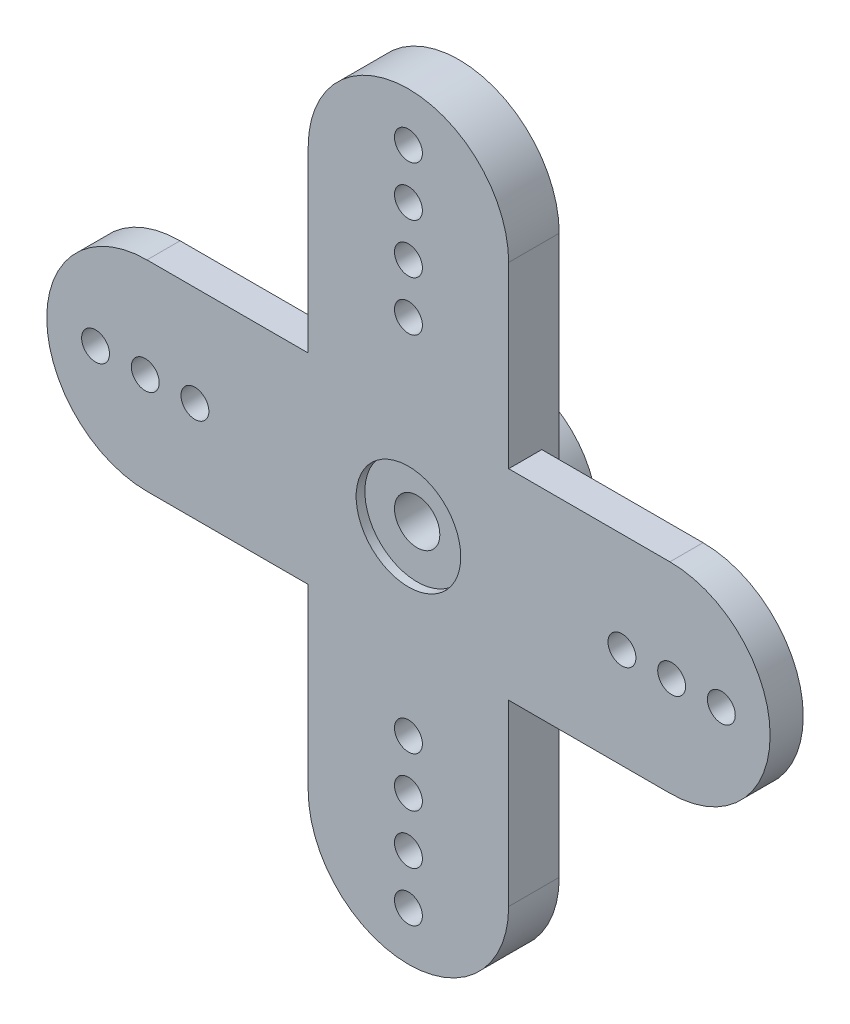
ISO-10303-21;
HEADER;
FILE_DESCRIPTION(('STEP AP214'),'2;1');
FILE_NAME('part.step','',(''),(''),'','','');
FILE_SCHEMA(('AUTOMOTIVE_DESIGN { 1 0 10303 214 1 1 1 1 }'));
ENDSEC;
DATA;
#1=APPLICATION_CONTEXT('core data for automotive mechanical design processes');
#2=APPLICATION_PROTOCOL_DEFINITION('international standard','automotive_design',2000,#1);
#3=PRODUCT_CONTEXT('',#1,'mechanical');
#4=PRODUCT('Part','Part','',(#3));
#5=PRODUCT_RELATED_PRODUCT_CATEGORY('part','',(#4));
#6=PRODUCT_DEFINITION_FORMATION('','',#4);
#7=PRODUCT_DEFINITION_CONTEXT('part definition',#1,'design');
#8=PRODUCT_DEFINITION('design','',#6,#7);
#9=PRODUCT_DEFINITION_SHAPE('','',#8);
#10=(LENGTH_UNIT() NAMED_UNIT(*) SI_UNIT(.MILLI.,.METRE.));
#11=(NAMED_UNIT(*) PLANE_ANGLE_UNIT() SI_UNIT($,.RADIAN.));
#12=(NAMED_UNIT(*) SI_UNIT($,.STERADIAN.) SOLID_ANGLE_UNIT());
#13=UNCERTAINTY_MEASURE_WITH_UNIT(LENGTH_MEASURE(1.E-05),#10,'distance_accuracy_value','');
#14=(GEOMETRIC_REPRESENTATION_CONTEXT(3) GLOBAL_UNCERTAINTY_ASSIGNED_CONTEXT((#13)) GLOBAL_UNIT_ASSIGNED_CONTEXT((#10,
#11,#12)) REPRESENTATION_CONTEXT('',''));
#15=CARTESIAN_POINT('',(0.,0.,0.));
#16=DIRECTION('',(0.,0.,1.));
#17=DIRECTION('',(1.,0.,0.));
#18=AXIS2_PLACEMENT_3D('',#15,#16,#17);
#19=CARTESIAN_POINT('',(0.,16.,-1.));
#20=DIRECTION('',(0.,0.,-1.));
#21=DIRECTION('',(-1.,0.,0.));
#22=AXIS2_PLACEMENT_3D('',#19,#20,#21);
#23=PLANE('',#22);
#24=CARTESIAN_POINT('',(0.,10.4,-1.));
#25=DIRECTION('',(0.,0.,-1.));
#26=DIRECTION('',(-1.,0.,0.));
#27=AXIS2_PLACEMENT_3D('',#24,#25,#26);
#28=CIRCLE('',#27,0.799999999999997);
#29=CARTESIAN_POINT('',(-0.799999999999997,10.4,-1.));
#30=VERTEX_POINT('',#29);
#31=EDGE_CURVE('E458',#30,#30,#28,.T.);
#32=ORIENTED_EDGE('',*,*,#31,.F.);
#33=EDGE_LOOP('',(#32));
#34=FACE_BOUND('',#33,.T.);
#35=CARTESIAN_POINT('',(0.,-18.95,-1.));
#36=DIRECTION('',(0.,0.,-1.));
#37=DIRECTION('',(-1.,0.,0.));
#38=AXIS2_PLACEMENT_3D('',#35,#36,#37);
#39=CIRCLE('',#38,0.799999999999997);
#40=CARTESIAN_POINT('',(-0.799999999999998,-18.95,-1.));
#41=VERTEX_POINT('',#40);
#42=EDGE_CURVE('E454',#41,#41,#39,.T.);
#43=ORIENTED_EDGE('',*,*,#42,.F.);
#44=EDGE_LOOP('',(#43));
#45=FACE_BOUND('',#44,.T.);
#46=CARTESIAN_POINT('',(0.,-16.1,-1.));
#47=DIRECTION('',(0.,0.,-1.));
#48=DIRECTION('',(-1.,0.,0.));
#49=AXIS2_PLACEMENT_3D('',#46,#47,#48);
#50=CIRCLE('',#49,0.799999999999999);
#51=CARTESIAN_POINT('',(-0.8,-16.1,-1.));
#52=VERTEX_POINT('',#51);
#53=EDGE_CURVE('E450',#52,#52,#50,.T.);
#54=ORIENTED_EDGE('',*,*,#53,.F.);
#55=EDGE_LOOP('',(#54));
#56=FACE_BOUND('',#55,.T.);
#57=CARTESIAN_POINT('',(0.,-13.25,-1.));
#58=DIRECTION('',(0.,0.,-1.));
#59=DIRECTION('',(-1.,0.,0.));
#60=AXIS2_PLACEMENT_3D('',#57,#58,#59);
#61=CIRCLE('',#60,0.8);
#62=CARTESIAN_POINT('',(-0.8,-13.25,-1.));
#63=VERTEX_POINT('',#62);
#64=EDGE_CURVE('E446',#63,#63,#61,.T.);
#65=ORIENTED_EDGE('',*,*,#64,.F.);
#66=EDGE_LOOP('',(#65));
#67=FACE_BOUND('',#66,.T.);
#68=CARTESIAN_POINT('',(0.,-10.4,-1.));
#69=DIRECTION('',(0.,0.,-1.));
#70=DIRECTION('',(-1.,0.,0.));
#71=AXIS2_PLACEMENT_3D('',#68,#69,#70);
#72=CIRCLE('',#71,0.799999999999999);
#73=CARTESIAN_POINT('',(-0.8,-10.4,-1.));
#74=VERTEX_POINT('',#73);
#75=EDGE_CURVE('E442',#74,#74,#72,.T.);
#76=ORIENTED_EDGE('',*,*,#75,.F.);
#77=EDGE_LOOP('',(#76));
#78=FACE_BOUND('',#77,.T.);
#79=CARTESIAN_POINT('',(0.,13.25,-1.));
#80=DIRECTION('',(0.,0.,-1.));
#81=DIRECTION('',(-1.,0.,0.));
#82=AXIS2_PLACEMENT_3D('',#79,#80,#81);
#83=CIRCLE('',#82,0.799999999999999);
#84=CARTESIAN_POINT('',(-0.799999999999998,13.25,-1.));
#85=VERTEX_POINT('',#84);
#86=EDGE_CURVE('E427',#85,#85,#83,.T.);
#87=ORIENTED_EDGE('',*,*,#86,.F.);
#88=EDGE_LOOP('',(#87));
#89=FACE_BOUND('',#88,.T.);
#90=CARTESIAN_POINT('',(0.,16.1,-1.));
#91=DIRECTION('',(0.,0.,-1.));
#92=DIRECTION('',(-1.,0.,0.));
#93=AXIS2_PLACEMENT_3D('',#90,#91,#92);
#94=CIRCLE('',#93,0.799999999999997);
#95=CARTESIAN_POINT('',(-0.799999999999997,16.1,-1.));
#96=VERTEX_POINT('',#95);
#97=EDGE_CURVE('E423',#96,#96,#94,.T.);
#98=ORIENTED_EDGE('',*,*,#97,.F.);
#99=EDGE_LOOP('',(#98));
#100=FACE_BOUND('',#99,.T.);
#101=CARTESIAN_POINT('',(0.,18.95,-1.));
#102=DIRECTION('',(0.,0.,-1.));
#103=DIRECTION('',(-1.,0.,0.));
#104=AXIS2_PLACEMENT_3D('',#101,#102,#103);
#105=CIRCLE('',#104,0.799999999999998);
#106=CARTESIAN_POINT('',(-0.799999999999998,18.95,-1.));
#107=VERTEX_POINT('',#106);
#108=EDGE_CURVE('E419',#107,#107,#105,.T.);
#109=ORIENTED_EDGE('',*,*,#108,.F.);
#110=EDGE_LOOP('',(#109));
#111=FACE_BOUND('',#110,.T.);
#112=CARTESIAN_POINT('',(0.,16.,-1.));
#113=DIRECTION('',(0.,0.,-1.));
#114=DIRECTION('',(-1.,0.,0.));
#115=AXIS2_PLACEMENT_3D('',#112,#113,#114);
#116=CIRCLE('',#115,5.75);
#117=CARTESIAN_POINT('',(-5.75,16.,-1.));
#118=VERTEX_POINT('',#117);
#119=CARTESIAN_POINT('',(5.75,16.,-1.));
#120=VERTEX_POINT('',#119);
#121=EDGE_CURVE('E218',#118,#120,#116,.T.);
#122=ORIENTED_EDGE('',*,*,#121,.T.);
#123=DIRECTION('',(0.,-1.,0.));
#124=VECTOR('',#123,1.);
#125=CARTESIAN_POINT('',(5.75,16.,-1.));
#126=LINE('',#125,#124);
#127=CARTESIAN_POINT('',(5.75000000000001,-16.,-1.));
#128=VERTEX_POINT('',#127);
#129=EDGE_CURVE('E220',#120,#128,#126,.T.);
#130=ORIENTED_EDGE('',*,*,#129,.T.);
#131=CARTESIAN_POINT('',(0.,-16.,-1.));
#132=DIRECTION('',(0.,0.,-1.));
#133=DIRECTION('',(-1.,0.,0.));
#134=AXIS2_PLACEMENT_3D('',#131,#132,#133);
#135=CIRCLE('',#134,5.75);
#136=CARTESIAN_POINT('',(-5.74999999999999,-16.,-1.));
#137=VERTEX_POINT('',#136);
#138=EDGE_CURVE('E226',#128,#137,#135,.T.);
#139=ORIENTED_EDGE('',*,*,#138,.T.);
#140=DIRECTION('',(0.,1.,0.));
#141=VECTOR('',#140,1.);
#142=CARTESIAN_POINT('',(-5.75,-5.74999999999999,-1.));
#143=LINE('',#142,#141);
#144=EDGE_CURVE('E187',#137,#118,#143,.T.);
#145=ORIENTED_EDGE('',*,*,#144,.T.);
#146=EDGE_LOOP('',(#122,#130,#139,#145));
#147=FACE_BOUND('',#146,.T.);
#148=CARTESIAN_POINT('',(0.,0.,-1.));
#149=DIRECTION('',(0.,0.,-1.));
#150=DIRECTION('',(-1.,0.,0.));
#151=AXIS2_PLACEMENT_3D('',#148,#149,#150);
#152=CIRCLE('',#151,4.825);
#153=CARTESIAN_POINT('',(-4.825,0.,-1.));
#154=VERTEX_POINT('',#153);
#155=EDGE_CURVE('E318',#154,#154,#152,.T.);
#156=ORIENTED_EDGE('',*,*,#155,.F.);
#157=EDGE_LOOP('',(#156));
#158=FACE_BOUND('',#157,.T.);
#159=ADVANCED_FACE('F33',(#34,#45,#56,#67,#78,#89,#100,#111,#147,#158),#23,.T.);
#160=CARTESIAN_POINT('',(0.,16.,0.));
#161=DIRECTION('',(0.,0.,1.));
#162=DIRECTION('',(1.,0.,0.));
#163=AXIS2_PLACEMENT_3D('',#160,#161,#162);
#164=PLANE('',#163);
#165=CARTESIAN_POINT('',(-12.25,0.,0.));
#166=DIRECTION('',(0.,0.,1.));
#167=DIRECTION('',(1.,0.,0.));
#168=AXIS2_PLACEMENT_3D('',#165,#166,#167);
#169=CIRCLE('',#168,0.800000000000003);
#170=CARTESIAN_POINT('',(-11.45,0.,0.));
#171=VERTEX_POINT('',#170);
#172=EDGE_CURVE('E415',#171,#171,#169,.T.);
#173=ORIENTED_EDGE('',*,*,#172,.T.);
#174=EDGE_LOOP('',(#173));
#175=FACE_BOUND('',#174,.T.);
#176=CARTESIAN_POINT('',(-15.1,0.,0.));
#177=DIRECTION('',(0.,0.,1.));
#178=DIRECTION('',(1.,0.,0.));
#179=AXIS2_PLACEMENT_3D('',#176,#177,#178);
#180=CIRCLE('',#179,0.799999999999999);
#181=CARTESIAN_POINT('',(-14.3,0.,0.));
#182=VERTEX_POINT('',#181);
#183=EDGE_CURVE('E410',#182,#182,#180,.T.);
#184=ORIENTED_EDGE('',*,*,#183,.T.);
#185=EDGE_LOOP('',(#184));
#186=FACE_BOUND('',#185,.T.);
#187=CARTESIAN_POINT('',(-17.95,0.,0.));
#188=DIRECTION('',(0.,0.,1.));
#189=DIRECTION('',(1.,0.,0.));
#190=AXIS2_PLACEMENT_3D('',#187,#188,#189);
#191=CIRCLE('',#190,0.799999999999999);
#192=CARTESIAN_POINT('',(-17.15,0.,0.));
#193=VERTEX_POINT('',#192);
#194=EDGE_CURVE('E306',#193,#193,#191,.T.);
#195=ORIENTED_EDGE('',*,*,#194,.T.);
#196=EDGE_LOOP('',(#195));
#197=FACE_BOUND('',#196,.T.);
#198=DIRECTION('',(0.,1.,0.));
#199=VECTOR('',#198,1.);
#200=CARTESIAN_POINT('',(-5.75,16.,0.));
#201=LINE('',#200,#199);
#202=CARTESIAN_POINT('',(-5.75,-5.74999999999999,0.));
#203=VERTEX_POINT('',#202);
#204=CARTESIAN_POINT('',(-5.75,5.75,0.));
#205=VERTEX_POINT('',#204);
#206=EDGE_CURVE('E42',#203,#205,#201,.T.);
#207=ORIENTED_EDGE('',*,*,#206,.F.);
#208=DIRECTION('',(1.,0.,0.));
#209=VECTOR('',#208,1.);
#210=CARTESIAN_POINT('',(-15.,-5.75,0.));
#211=LINE('',#210,#209);
#212=CARTESIAN_POINT('',(-15.,-5.75,0.));
#213=VERTEX_POINT('',#212);
#214=EDGE_CURVE('E139',#213,#203,#211,.T.);
#215=ORIENTED_EDGE('',*,*,#214,.F.);
#216=CARTESIAN_POINT('',(-15.,0.,0.));
#217=DIRECTION('',(0.,0.,1.));
#218=DIRECTION('',(1.,0.,0.));
#219=AXIS2_PLACEMENT_3D('',#216,#217,#218);
#220=CIRCLE('',#219,5.75);
#221=CARTESIAN_POINT('',(-15.,5.75,0.));
#222=VERTEX_POINT('',#221);
#223=EDGE_CURVE('E137',#222,#213,#220,.T.);
#224=ORIENTED_EDGE('',*,*,#223,.F.);
#225=DIRECTION('',(-1.,0.,0.));
#226=VECTOR('',#225,1.);
#227=CARTESIAN_POINT('',(-15.,5.75,0.));
#228=LINE('',#227,#226);
#229=EDGE_CURVE('E140',#205,#222,#228,.T.);
#230=ORIENTED_EDGE('',*,*,#229,.F.);
#231=EDGE_LOOP('',(#207,#215,#224,#230));
#232=FACE_BOUND('',#231,.T.);
#233=ADVANCED_FACE('F260',(#175,#186,#197,#232),#164,.F.);
#234=CARTESIAN_POINT('',(17.95,0.,0.));
#235=DIRECTION('',(0.,0.,1.));
#236=DIRECTION('',(1.,0.,0.));
#237=AXIS2_PLACEMENT_3D('',#234,#235,#236);
#238=CIRCLE('',#237,0.799999999999999);
#239=CARTESIAN_POINT('',(18.75,0.,0.));
#240=VERTEX_POINT('',#239);
#241=EDGE_CURVE('E439',#240,#240,#238,.T.);
#242=ORIENTED_EDGE('',*,*,#241,.T.);
#243=EDGE_LOOP('',(#242));
#244=FACE_BOUND('',#243,.T.);
#245=CARTESIAN_POINT('',(15.1,0.,0.));
#246=DIRECTION('',(0.,0.,1.));
#247=DIRECTION('',(1.,0.,0.));
#248=AXIS2_PLACEMENT_3D('',#245,#246,#247);
#249=CIRCLE('',#248,0.800000000000001);
#250=CARTESIAN_POINT('',(15.9,0.,0.));
#251=VERTEX_POINT('',#250);
#252=EDGE_CURVE('E435',#251,#251,#249,.T.);
#253=ORIENTED_EDGE('',*,*,#252,.T.);
#254=EDGE_LOOP('',(#253));
#255=FACE_BOUND('',#254,.T.);
#256=CARTESIAN_POINT('',(12.25,0.,0.));
#257=DIRECTION('',(0.,0.,1.));
#258=DIRECTION('',(1.,0.,0.));
#259=AXIS2_PLACEMENT_3D('',#256,#257,#258);
#260=CIRCLE('',#259,0.800000000000003);
#261=CARTESIAN_POINT('',(13.05,0.,0.));
#262=VERTEX_POINT('',#261);
#263=EDGE_CURVE('E431',#262,#262,#260,.T.);
#264=ORIENTED_EDGE('',*,*,#263,.T.);
#265=EDGE_LOOP('',(#264));
#266=FACE_BOUND('',#265,.T.);
#267=DIRECTION('',(0.,-1.,0.));
#268=VECTOR('',#267,1.);
#269=CARTESIAN_POINT('',(5.75,16.,0.));
#270=LINE('',#269,#268);
#271=CARTESIAN_POINT('',(5.75,5.75,0.));
#272=VERTEX_POINT('',#271);
#273=CARTESIAN_POINT('',(5.75,-5.74999999999999,0.));
#274=VERTEX_POINT('',#273);
#275=EDGE_CURVE('E163',#272,#274,#270,.T.);
#276=ORIENTED_EDGE('',*,*,#275,.F.);
#277=DIRECTION('',(-1.,0.,0.));
#278=VECTOR('',#277,1.);
#279=CARTESIAN_POINT('',(5.75,5.74999999999999,0.));
#280=LINE('',#279,#278);
#281=CARTESIAN_POINT('',(15.,5.75,0.));
#282=VERTEX_POINT('',#281);
#283=EDGE_CURVE('E142',#282,#272,#280,.T.);
#284=ORIENTED_EDGE('',*,*,#283,.F.);
#285=CARTESIAN_POINT('',(15.,0.,0.));
#286=DIRECTION('',(0.,0.,1.));
#287=DIRECTION('',(1.,0.,0.));
#288=AXIS2_PLACEMENT_3D('',#285,#286,#287);
#289=CIRCLE('',#288,5.75);
#290=CARTESIAN_POINT('',(15.,-5.75,0.));
#291=VERTEX_POINT('',#290);
#292=EDGE_CURVE('E78',#291,#282,#289,.T.);
#293=ORIENTED_EDGE('',*,*,#292,.F.);
#294=DIRECTION('',(1.,0.,0.));
#295=VECTOR('',#294,1.);
#296=CARTESIAN_POINT('',(5.75,-5.74999999999999,0.));
#297=LINE('',#296,#295);
#298=EDGE_CURVE('E71',#274,#291,#297,.T.);
#299=ORIENTED_EDGE('',*,*,#298,.F.);
#300=EDGE_LOOP('',(#276,#284,#293,#299));
#301=FACE_BOUND('',#300,.T.);
#302=ADVANCED_FACE('F256',(#244,#255,#266,#301),#164,.F.);
#303=CARTESIAN_POINT('',(0.,16.,1.9));
#304=DIRECTION('',(0.,0.,-1.));
#305=DIRECTION('',(-1.,0.,0.));
#306=AXIS2_PLACEMENT_3D('',#303,#304,#305);
#307=CYLINDRICAL_SURFACE('',#306,5.75);
#308=DIRECTION('',(0.,0.,-1.));
#309=VECTOR('',#308,1.);
#310=CARTESIAN_POINT('',(5.75,16.,1.9));
#311=LINE('',#310,#309);
#312=CARTESIAN_POINT('',(5.75,16.,1.9));
#313=VERTEX_POINT('',#312);
#314=EDGE_CURVE('E133',#313,#120,#311,.T.);
#315=ORIENTED_EDGE('',*,*,#314,.T.);
#316=ORIENTED_EDGE('',*,*,#121,.F.);
#317=DIRECTION('',(0.,0.,-1.));
#318=VECTOR('',#317,1.);
#319=CARTESIAN_POINT('',(-5.75,16.,1.9));
#320=LINE('',#319,#318);
#321=CARTESIAN_POINT('',(-5.75,16.,1.9));
#322=VERTEX_POINT('',#321);
#323=EDGE_CURVE('E161',#322,#118,#320,.T.);
#324=ORIENTED_EDGE('',*,*,#323,.F.);
#325=CARTESIAN_POINT('',(0.,16.,1.9));
#326=DIRECTION('',(0.,0.,1.));
#327=DIRECTION('',(1.,0.,0.));
#328=AXIS2_PLACEMENT_3D('',#325,#326,#327);
#329=CIRCLE('',#328,5.75);
#330=EDGE_CURVE('E191',#313,#322,#329,.T.);
#331=ORIENTED_EDGE('',*,*,#330,.F.);
#332=EDGE_LOOP('',(#315,#316,#324,#331));
#333=FACE_BOUND('',#332,.T.);
#334=ADVANCED_FACE('F35',(#333),#307,.T.);
#335=CARTESIAN_POINT('',(-15.,5.75,1.9));
#336=DIRECTION('',(0.,-1.,0.));
#337=DIRECTION('',(1.,0.,0.));
#338=AXIS2_PLACEMENT_3D('',#335,#336,#337);
#339=PLANE('',#338);
#340=ORIENTED_EDGE('',*,*,#229,.T.);
#341=DIRECTION('',(0.,0.,-1.));
#342=VECTOR('',#341,1.);
#343=CARTESIAN_POINT('',(-15.,5.75,1.9));
#344=LINE('',#343,#342);
#345=CARTESIAN_POINT('',(-15.,5.75,1.9));
#346=VERTEX_POINT('',#345);
#347=EDGE_CURVE('E157',#346,#222,#344,.T.);
#348=ORIENTED_EDGE('',*,*,#347,.F.);
#349=DIRECTION('',(-1.,0.,0.));
#350=VECTOR('',#349,1.);
#351=CARTESIAN_POINT('',(-15.,5.75,1.9));
#352=LINE('',#351,#350);
#353=CARTESIAN_POINT('',(-5.75,5.74999999999999,1.9));
#354=VERTEX_POINT('',#353);
#355=EDGE_CURVE('E242',#354,#346,#352,.T.);
#356=ORIENTED_EDGE('',*,*,#355,.F.);
#357=DIRECTION('',(0.,0.,-1.));
#358=VECTOR('',#357,1.);
#359=CARTESIAN_POINT('',(-5.75,5.74999999999999,1.9));
#360=LINE('',#359,#358);
#361=EDGE_CURVE('E160',#354,#205,#360,.T.);
#362=ORIENTED_EDGE('',*,*,#361,.T.);
#363=EDGE_LOOP('',(#340,#348,#356,#362));
#364=FACE_BOUND('',#363,.T.);
#365=ADVANCED_FACE('F268',(#364),#339,.F.);
#366=CARTESIAN_POINT('',(-15.,0.,1.9));
#367=DIRECTION('',(0.,0.,-1.));
#368=DIRECTION('',(-1.,0.,0.));
#369=AXIS2_PLACEMENT_3D('',#366,#367,#368);
#370=CYLINDRICAL_SURFACE('',#369,5.75);
#371=ORIENTED_EDGE('',*,*,#223,.T.);
#372=DIRECTION('',(0.,0.,-1.));
#373=VECTOR('',#372,1.);
#374=CARTESIAN_POINT('',(-15.,-5.75,1.9));
#375=LINE('',#374,#373);
#376=CARTESIAN_POINT('',(-15.,-5.75,1.9));
#377=VERTEX_POINT('',#376);
#378=EDGE_CURVE('E154',#377,#213,#375,.T.);
#379=ORIENTED_EDGE('',*,*,#378,.F.);
#380=CARTESIAN_POINT('',(-15.,0.,1.9));
#381=DIRECTION('',(0.,0.,1.));
#382=DIRECTION('',(1.,0.,0.));
#383=AXIS2_PLACEMENT_3D('',#380,#381,#382);
#384=CIRCLE('',#383,5.75);
#385=EDGE_CURVE('E244',#346,#377,#384,.T.);
#386=ORIENTED_EDGE('',*,*,#385,.F.);
#387=ORIENTED_EDGE('',*,*,#347,.T.);
#388=EDGE_LOOP('',(#371,#379,#386,#387));
#389=FACE_BOUND('',#388,.T.);
#390=ADVANCED_FACE('F538',(#389),#370,.T.);
#391=CARTESIAN_POINT('',(-15.,-5.75,1.9));
#392=DIRECTION('',(0.,1.,0.));
#393=DIRECTION('',(-1.,0.,0.));
#394=AXIS2_PLACEMENT_3D('',#391,#392,#393);
#395=PLANE('',#394);
#396=ORIENTED_EDGE('',*,*,#214,.T.);
#397=DIRECTION('',(0.,0.,-1.));
#398=VECTOR('',#397,1.);
#399=CARTESIAN_POINT('',(-5.75,-5.74999999999999,1.9));
#400=LINE('',#399,#398);
#401=CARTESIAN_POINT('',(-5.75,-5.74999999999999,1.9));
#402=VERTEX_POINT('',#401);
#403=EDGE_CURVE('E153',#402,#203,#400,.T.);
#404=ORIENTED_EDGE('',*,*,#403,.F.);
#405=DIRECTION('',(1.,0.,0.));
#406=VECTOR('',#405,1.);
#407=CARTESIAN_POINT('',(-15.,-5.75,1.9));
#408=LINE('',#407,#406);
#409=EDGE_CURVE('E246',#377,#402,#408,.T.);
#410=ORIENTED_EDGE('',*,*,#409,.F.);
#411=ORIENTED_EDGE('',*,*,#378,.T.);
#412=EDGE_LOOP('',(#396,#404,#410,#411));
#413=FACE_BOUND('',#412,.T.);
#414=ADVANCED_FACE('F528',(#413),#395,.F.);
#415=CARTESIAN_POINT('',(-5.75,-5.74999999999999,1.9));
#416=DIRECTION('',(1.,0.,0.));
#417=DIRECTION('',(0.,1.,0.));
#418=AXIS2_PLACEMENT_3D('',#415,#416,#417);
#419=PLANE('',#418);
#420=ORIENTED_EDGE('',*,*,#403,.T.);
#421=ORIENTED_EDGE('',*,*,#206,.T.);
#422=ORIENTED_EDGE('',*,*,#361,.F.);
#423=DIRECTION('',(0.,-1.,0.));
#424=VECTOR('',#423,1.);
#425=CARTESIAN_POINT('',(-5.75,16.,1.9));
#426=LINE('',#425,#424);
#427=EDGE_CURVE('E87',#322,#354,#426,.T.);
#428=ORIENTED_EDGE('',*,*,#427,.F.);
#429=ORIENTED_EDGE('',*,*,#323,.T.);
#430=ORIENTED_EDGE('',*,*,#144,.F.);
#431=DIRECTION('',(0.,0.,-1.));
#432=VECTOR('',#431,1.);
#433=CARTESIAN_POINT('',(-5.74999999999999,-16.,1.9));
#434=LINE('',#433,#432);
#435=CARTESIAN_POINT('',(-5.74999999999999,-16.,1.9));
#436=VERTEX_POINT('',#435);
#437=EDGE_CURVE('E150',#436,#137,#434,.T.);
#438=ORIENTED_EDGE('',*,*,#437,.F.);
#439=DIRECTION('',(0.,-1.,0.));
#440=VECTOR('',#439,1.);
#441=CARTESIAN_POINT('',(-5.75,-5.74999999999999,1.9));
#442=LINE('',#441,#440);
#443=EDGE_CURVE('E248',#402,#436,#442,.T.);
#444=ORIENTED_EDGE('',*,*,#443,.F.);
#445=EDGE_LOOP('',(#420,#421,#422,#428,#429,#430,#438,#444));
#446=FACE_BOUND('',#445,.T.);
#447=ADVANCED_FACE('F532',(#446),#419,.F.);
#448=CARTESIAN_POINT('',(0.,-16.,1.9));
#449=DIRECTION('',(0.,0.,-1.));
#450=DIRECTION('',(-1.,0.,0.));
#451=AXIS2_PLACEMENT_3D('',#448,#449,#450);
#452=CYLINDRICAL_SURFACE('',#451,5.75);
#453=ORIENTED_EDGE('',*,*,#437,.T.);
#454=ORIENTED_EDGE('',*,*,#138,.F.);
#455=DIRECTION('',(0.,0.,-1.));
#456=VECTOR('',#455,1.);
#457=CARTESIAN_POINT('',(5.75000000000001,-16.,1.9));
#458=LINE('',#457,#456);
#459=CARTESIAN_POINT('',(5.75000000000001,-16.,1.9));
#460=VERTEX_POINT('',#459);
#461=EDGE_CURVE('E147',#460,#128,#458,.T.);
#462=ORIENTED_EDGE('',*,*,#461,.F.);
#463=CARTESIAN_POINT('',(0.,-16.,1.9));
#464=DIRECTION('',(0.,0.,1.));
#465=DIRECTION('',(1.,0.,0.));
#466=AXIS2_PLACEMENT_3D('',#463,#464,#465);
#467=CIRCLE('',#466,5.75);
#468=EDGE_CURVE('E250',#436,#460,#467,.T.);
#469=ORIENTED_EDGE('',*,*,#468,.F.);
#470=EDGE_LOOP('',(#453,#454,#462,#469));
#471=FACE_BOUND('',#470,.T.);
#472=ADVANCED_FACE('F550',(#471),#452,.T.);
#473=CARTESIAN_POINT('',(5.75,-5.74999999999999,1.9));
#474=DIRECTION('',(0.,1.,0.));
#475=DIRECTION('',(-1.,0.,0.));
#476=AXIS2_PLACEMENT_3D('',#473,#474,#475);
#477=PLANE('',#476);
#478=ORIENTED_EDGE('',*,*,#298,.T.);
#479=DIRECTION('',(0.,0.,-1.));
#480=VECTOR('',#479,1.);
#481=CARTESIAN_POINT('',(15.,-5.75,1.9));
#482=LINE('',#481,#480);
#483=CARTESIAN_POINT('',(15.,-5.75,1.9));
#484=VERTEX_POINT('',#483);
#485=EDGE_CURVE('E127',#484,#291,#482,.T.);
#486=ORIENTED_EDGE('',*,*,#485,.F.);
#487=DIRECTION('',(1.,0.,0.));
#488=VECTOR('',#487,1.);
#489=CARTESIAN_POINT('',(5.75,-5.74999999999999,1.9));
#490=LINE('',#489,#488);
#491=CARTESIAN_POINT('',(5.75,-5.74999999999999,1.9));
#492=VERTEX_POINT('',#491);
#493=EDGE_CURVE('E120',#492,#484,#490,.T.);
#494=ORIENTED_EDGE('',*,*,#493,.F.);
#495=DIRECTION('',(0.,0.,-1.));
#496=VECTOR('',#495,1.);
#497=CARTESIAN_POINT('',(5.75,-5.74999999999999,1.9));
#498=LINE('',#497,#496);
#499=EDGE_CURVE('E146',#492,#274,#498,.T.);
#500=ORIENTED_EDGE('',*,*,#499,.T.);
#501=EDGE_LOOP('',(#478,#486,#494,#500));
#502=FACE_BOUND('',#501,.T.);
#503=ADVANCED_FACE('F255',(#502),#477,.F.);
#504=CARTESIAN_POINT('',(15.,0.,1.9));
#505=DIRECTION('',(0.,0.,-1.));
#506=DIRECTION('',(-1.,0.,0.));
#507=AXIS2_PLACEMENT_3D('',#504,#505,#506);
#508=CYLINDRICAL_SURFACE('',#507,5.75);
#509=ORIENTED_EDGE('',*,*,#292,.T.);
#510=DIRECTION('',(0.,0.,-1.));
#511=VECTOR('',#510,1.);
#512=CARTESIAN_POINT('',(15.,5.75,1.9));
#513=LINE('',#512,#511);
#514=CARTESIAN_POINT('',(15.,5.75,1.9));
#515=VERTEX_POINT('',#514);
#516=EDGE_CURVE('E122',#515,#282,#513,.T.);
#517=ORIENTED_EDGE('',*,*,#516,.F.);
#518=CARTESIAN_POINT('',(15.,0.,1.9));
#519=DIRECTION('',(0.,0.,1.));
#520=DIRECTION('',(1.,0.,0.));
#521=AXIS2_PLACEMENT_3D('',#518,#519,#520);
#522=CIRCLE('',#521,5.75);
#523=EDGE_CURVE('E114',#484,#515,#522,.T.);
#524=ORIENTED_EDGE('',*,*,#523,.F.);
#525=ORIENTED_EDGE('',*,*,#485,.T.);
#526=EDGE_LOOP('',(#509,#517,#524,#525));
#527=FACE_BOUND('',#526,.T.);
#528=ADVANCED_FACE('F123',(#527),#508,.T.);
#529=CARTESIAN_POINT('',(5.75,5.74999999999999,1.9));
#530=DIRECTION('',(0.,-1.,0.));
#531=DIRECTION('',(1.,0.,0.));
#532=AXIS2_PLACEMENT_3D('',#529,#530,#531);
#533=PLANE('',#532);
#534=ORIENTED_EDGE('',*,*,#283,.T.);
#535=DIRECTION('',(0.,0.,-1.));
#536=VECTOR('',#535,1.);
#537=CARTESIAN_POINT('',(5.75,5.74999999999999,1.9));
#538=LINE('',#537,#536);
#539=CARTESIAN_POINT('',(5.75,5.74999999999999,1.9));
#540=VERTEX_POINT('',#539);
#541=EDGE_CURVE('E128',#540,#272,#538,.T.);
#542=ORIENTED_EDGE('',*,*,#541,.F.);
#543=DIRECTION('',(-1.,0.,0.));
#544=VECTOR('',#543,1.);
#545=CARTESIAN_POINT('',(5.75,5.74999999999999,1.9));
#546=LINE('',#545,#544);
#547=EDGE_CURVE('E117',#515,#540,#546,.T.);
#548=ORIENTED_EDGE('',*,*,#547,.F.);
#549=ORIENTED_EDGE('',*,*,#516,.T.);
#550=EDGE_LOOP('',(#534,#542,#548,#549));
#551=FACE_BOUND('',#550,.T.);
#552=ADVANCED_FACE('F130',(#551),#533,.F.);
#553=CARTESIAN_POINT('',(5.75,5.74999999999999,1.9));
#554=DIRECTION('',(-1.,0.,0.));
#555=DIRECTION('',(0.,-1.,0.));
#556=AXIS2_PLACEMENT_3D('',#553,#554,#555);
#557=PLANE('',#556);
#558=ORIENTED_EDGE('',*,*,#541,.T.);
#559=ORIENTED_EDGE('',*,*,#275,.T.);
#560=ORIENTED_EDGE('',*,*,#499,.F.);
#561=DIRECTION('',(0.,1.,0.));
#562=VECTOR('',#561,1.);
#563=CARTESIAN_POINT('',(5.75000000000001,-16.,1.9));
#564=LINE('',#563,#562);
#565=EDGE_CURVE('E252',#460,#492,#564,.T.);
#566=ORIENTED_EDGE('',*,*,#565,.F.);
#567=ORIENTED_EDGE('',*,*,#461,.T.);
#568=ORIENTED_EDGE('',*,*,#129,.F.);
#569=ORIENTED_EDGE('',*,*,#314,.F.);
#570=DIRECTION('',(0.,1.,0.));
#571=VECTOR('',#570,1.);
#572=CARTESIAN_POINT('',(5.75,5.74999999999999,1.9));
#573=LINE('',#572,#571);
#574=EDGE_CURVE('E50',#540,#313,#573,.T.);
#575=ORIENTED_EDGE('',*,*,#574,.F.);
#576=EDGE_LOOP('',(#558,#559,#560,#566,#567,#568,#569,#575));
#577=FACE_BOUND('',#576,.T.);
#578=ADVANCED_FACE('F196',(#577),#557,.F.);
#579=CARTESIAN_POINT('',(0.,16.,1.9));
#580=DIRECTION('',(0.,0.,1.));
#581=DIRECTION('',(1.,0.,0.));
#582=AXIS2_PLACEMENT_3D('',#579,#580,#581);
#583=PLANE('',#582);
#584=CARTESIAN_POINT('',(0.,10.4,1.9));
#585=DIRECTION('',(0.,0.,1.));
#586=DIRECTION('',(1.,0.,0.));
#587=AXIS2_PLACEMENT_3D('',#584,#585,#586);
#588=CIRCLE('',#587,0.799999999999997);
#589=CARTESIAN_POINT('',(0.799999999999998,10.4,1.9));
#590=VERTEX_POINT('',#589);
#591=EDGE_CURVE('E358',#590,#590,#588,.T.);
#592=ORIENTED_EDGE('',*,*,#591,.F.);
#593=EDGE_LOOP('',(#592));
#594=FACE_BOUND('',#593,.T.);
#595=CARTESIAN_POINT('',(0.,-18.95,1.9));
#596=DIRECTION('',(0.,0.,1.));
#597=DIRECTION('',(1.,0.,0.));
#598=AXIS2_PLACEMENT_3D('',#595,#596,#597);
#599=CIRCLE('',#598,0.799999999999997);
#600=CARTESIAN_POINT('',(0.799999999999997,-18.95,1.9));
#601=VERTEX_POINT('',#600);
#602=EDGE_CURVE('E362',#601,#601,#599,.T.);
#603=ORIENTED_EDGE('',*,*,#602,.F.);
#604=EDGE_LOOP('',(#603));
#605=FACE_BOUND('',#604,.T.);
#606=CARTESIAN_POINT('',(0.,-16.1,1.9));
#607=DIRECTION('',(0.,0.,1.));
#608=DIRECTION('',(1.,0.,0.));
#609=AXIS2_PLACEMENT_3D('',#606,#607,#608);
#610=CIRCLE('',#609,0.799999999999999);
#611=CARTESIAN_POINT('',(0.799999999999998,-16.1,1.9));
#612=VERTEX_POINT('',#611);
#613=EDGE_CURVE('E366',#612,#612,#610,.T.);
#614=ORIENTED_EDGE('',*,*,#613,.F.);
#615=EDGE_LOOP('',(#614));
#616=FACE_BOUND('',#615,.T.);
#617=CARTESIAN_POINT('',(0.,-13.25,1.9));
#618=DIRECTION('',(0.,0.,1.));
#619=DIRECTION('',(1.,0.,0.));
#620=AXIS2_PLACEMENT_3D('',#617,#618,#619);
#621=CIRCLE('',#620,0.8);
#622=CARTESIAN_POINT('',(0.799999999999999,-13.25,1.9));
#623=VERTEX_POINT('',#622);
#624=EDGE_CURVE('E370',#623,#623,#621,.T.);
#625=ORIENTED_EDGE('',*,*,#624,.F.);
#626=EDGE_LOOP('',(#625));
#627=FACE_BOUND('',#626,.T.);
#628=CARTESIAN_POINT('',(0.,-10.4,1.9));
#629=DIRECTION('',(0.,0.,1.));
#630=DIRECTION('',(1.,0.,0.));
#631=AXIS2_PLACEMENT_3D('',#628,#629,#630);
#632=CIRCLE('',#631,0.799999999999999);
#633=CARTESIAN_POINT('',(0.799999999999999,-10.4,1.9));
#634=VERTEX_POINT('',#633);
#635=EDGE_CURVE('E374',#634,#634,#632,.T.);
#636=ORIENTED_EDGE('',*,*,#635,.F.);
#637=EDGE_LOOP('',(#636));
#638=FACE_BOUND('',#637,.T.);
#639=CARTESIAN_POINT('',(17.95,0.,1.9));
#640=DIRECTION('',(0.,0.,1.));
#641=DIRECTION('',(1.,0.,0.));
#642=AXIS2_PLACEMENT_3D('',#639,#640,#641);
#643=CIRCLE('',#642,0.799999999999999);
#644=CARTESIAN_POINT('',(18.75,0.,1.9));
#645=VERTEX_POINT('',#644);
#646=EDGE_CURVE('E378',#645,#645,#643,.T.);
#647=ORIENTED_EDGE('',*,*,#646,.F.);
#648=EDGE_LOOP('',(#647));
#649=FACE_BOUND('',#648,.T.);
#650=CARTESIAN_POINT('',(15.1,0.,1.9));
#651=DIRECTION('',(0.,0.,1.));
#652=DIRECTION('',(1.,0.,0.));
#653=AXIS2_PLACEMENT_3D('',#650,#651,#652);
#654=CIRCLE('',#653,0.800000000000001);
#655=CARTESIAN_POINT('',(15.9,0.,1.9));
#656=VERTEX_POINT('',#655);
#657=EDGE_CURVE('E382',#656,#656,#654,.T.);
#658=ORIENTED_EDGE('',*,*,#657,.F.);
#659=EDGE_LOOP('',(#658));
#660=FACE_BOUND('',#659,.T.);
#661=CARTESIAN_POINT('',(12.25,0.,1.9));
#662=DIRECTION('',(0.,0.,1.));
#663=DIRECTION('',(1.,0.,0.));
#664=AXIS2_PLACEMENT_3D('',#661,#662,#663);
#665=CIRCLE('',#664,0.800000000000003);
#666=CARTESIAN_POINT('',(13.05,0.,1.9));
#667=VERTEX_POINT('',#666);
#668=EDGE_CURVE('E386',#667,#667,#665,.T.);
#669=ORIENTED_EDGE('',*,*,#668,.F.);
#670=EDGE_LOOP('',(#669));
#671=FACE_BOUND('',#670,.T.);
#672=CARTESIAN_POINT('',(0.,13.25,1.9));
#673=DIRECTION('',(0.,0.,1.));
#674=DIRECTION('',(1.,0.,0.));
#675=AXIS2_PLACEMENT_3D('',#672,#673,#674);
#676=CIRCLE('',#675,0.799999999999999);
#677=CARTESIAN_POINT('',(0.799999999999999,13.25,1.9));
#678=VERTEX_POINT('',#677);
#679=EDGE_CURVE('E390',#678,#678,#676,.T.);
#680=ORIENTED_EDGE('',*,*,#679,.F.);
#681=EDGE_LOOP('',(#680));
#682=FACE_BOUND('',#681,.T.);
#683=CARTESIAN_POINT('',(0.,16.1,1.9));
#684=DIRECTION('',(0.,0.,1.));
#685=DIRECTION('',(1.,0.,0.));
#686=AXIS2_PLACEMENT_3D('',#683,#684,#685);
#687=CIRCLE('',#686,0.799999999999997);
#688=CARTESIAN_POINT('',(0.799999999999998,16.1,1.9));
#689=VERTEX_POINT('',#688);
#690=EDGE_CURVE('E394',#689,#689,#687,.T.);
#691=ORIENTED_EDGE('',*,*,#690,.F.);
#692=EDGE_LOOP('',(#691));
#693=FACE_BOUND('',#692,.T.);
#694=CARTESIAN_POINT('',(0.,18.95,1.9));
#695=DIRECTION('',(0.,0.,1.));
#696=DIRECTION('',(1.,0.,0.));
#697=AXIS2_PLACEMENT_3D('',#694,#695,#696);
#698=CIRCLE('',#697,0.799999999999998);
#699=CARTESIAN_POINT('',(0.799999999999998,18.95,1.9));
#700=VERTEX_POINT('',#699);
#701=EDGE_CURVE('E398',#700,#700,#698,.T.);
#702=ORIENTED_EDGE('',*,*,#701,.F.);
#703=EDGE_LOOP('',(#702));
#704=FACE_BOUND('',#703,.T.);
#705=CARTESIAN_POINT('',(-12.25,0.,1.9));
#706=DIRECTION('',(0.,0.,1.));
#707=DIRECTION('',(1.,0.,0.));
#708=AXIS2_PLACEMENT_3D('',#705,#706,#707);
#709=CIRCLE('',#708,0.800000000000003);
#710=CARTESIAN_POINT('',(-11.45,0.,1.9));
#711=VERTEX_POINT('',#710);
#712=EDGE_CURVE('E402',#711,#711,#709,.T.);
#713=ORIENTED_EDGE('',*,*,#712,.F.);
#714=EDGE_LOOP('',(#713));
#715=FACE_BOUND('',#714,.T.);
#716=CARTESIAN_POINT('',(-15.1,0.,1.9));
#717=DIRECTION('',(0.,0.,1.));
#718=DIRECTION('',(1.,0.,0.));
#719=AXIS2_PLACEMENT_3D('',#716,#717,#718);
#720=CIRCLE('',#719,0.799999999999999);
#721=CARTESIAN_POINT('',(-14.3,0.,1.9));
#722=VERTEX_POINT('',#721);
#723=EDGE_CURVE('E406',#722,#722,#720,.T.);
#724=ORIENTED_EDGE('',*,*,#723,.F.);
#725=EDGE_LOOP('',(#724));
#726=FACE_BOUND('',#725,.T.);
#727=CARTESIAN_POINT('',(-17.95,0.,1.9));
#728=DIRECTION('',(0.,0.,1.));
#729=DIRECTION('',(1.,0.,0.));
#730=AXIS2_PLACEMENT_3D('',#727,#728,#729);
#731=CIRCLE('',#730,0.799999999999999);
#732=CARTESIAN_POINT('',(-17.15,0.,1.9));
#733=VERTEX_POINT('',#732);
#734=EDGE_CURVE('E312',#733,#733,#731,.T.);
#735=ORIENTED_EDGE('',*,*,#734,.F.);
#736=EDGE_LOOP('',(#735));
#737=FACE_BOUND('',#736,.T.);
#738=CARTESIAN_POINT('',(0.,0.,1.9));
#739=DIRECTION('',(0.,0.,1.));
#740=DIRECTION('',(1.,0.,0.));
#741=AXIS2_PLACEMENT_3D('',#738,#739,#740);
#742=CIRCLE('',#741,3.);
#743=CARTESIAN_POINT('',(3.,0.,1.9));
#744=VERTEX_POINT('',#743);
#745=EDGE_CURVE('E234',#744,#744,#742,.T.);
#746=ORIENTED_EDGE('',*,*,#745,.F.);
#747=EDGE_LOOP('',(#746));
#748=FACE_BOUND('',#747,.T.);
#749=ORIENTED_EDGE('',*,*,#330,.T.);
#750=ORIENTED_EDGE('',*,*,#427,.T.);
#751=ORIENTED_EDGE('',*,*,#355,.T.);
#752=ORIENTED_EDGE('',*,*,#385,.T.);
#753=ORIENTED_EDGE('',*,*,#409,.T.);
#754=ORIENTED_EDGE('',*,*,#443,.T.);
#755=ORIENTED_EDGE('',*,*,#468,.T.);
#756=ORIENTED_EDGE('',*,*,#565,.T.);
#757=ORIENTED_EDGE('',*,*,#493,.T.);
#758=ORIENTED_EDGE('',*,*,#523,.T.);
#759=ORIENTED_EDGE('',*,*,#547,.T.);
#760=ORIENTED_EDGE('',*,*,#574,.T.);
#761=EDGE_LOOP('',(#749,#750,#751,#752,#753,#754,#755,#756,#757,#758,#759,#760));
#762=FACE_BOUND('',#761,.T.);
#763=ADVANCED_FACE('F115',(#594,#605,#616,#627,#638,#649,#660,#671,#682,#693,#704,#715,#726,
#737,#748,#762),#583,.T.);
#764=CARTESIAN_POINT('',(0.,0.,1.4));
#765=DIRECTION('',(0.,0.,1.));
#766=DIRECTION('',(1.,0.,0.));
#767=AXIS2_PLACEMENT_3D('',#764,#765,#766);
#768=CYLINDRICAL_SURFACE('',#767,3.);
#769=CARTESIAN_POINT('',(0.,0.,1.4));
#770=DIRECTION('',(0.,0.,1.));
#771=DIRECTION('',(1.,0.,0.));
#772=AXIS2_PLACEMENT_3D('',#769,#770,#771);
#773=CIRCLE('',#772,3.);
#774=CARTESIAN_POINT('',(3.,0.,1.4));
#775=VERTEX_POINT('',#774);
#776=EDGE_CURVE('E231',#775,#775,#773,.T.);
#777=ORIENTED_EDGE('',*,*,#776,.F.);
#778=EDGE_LOOP('',(#777));
#779=FACE_BOUND('',#778,.T.);
#780=ORIENTED_EDGE('',*,*,#745,.T.);
#781=EDGE_LOOP('',(#780));
#782=FACE_BOUND('',#781,.T.);
#783=ADVANCED_FACE('F338',(#779,#782),#768,.F.);
#784=CARTESIAN_POINT('',(0.,0.,1.4));
#785=DIRECTION('',(0.,0.,1.));
#786=DIRECTION('',(1.,0.,0.));
#787=AXIS2_PLACEMENT_3D('',#784,#785,#786);
#788=PLANE('',#787);
#789=CARTESIAN_POINT('',(0.,0.,1.4));
#790=DIRECTION('',(0.,0.,1.));
#791=DIRECTION('',(1.,0.,0.));
#792=AXIS2_PLACEMENT_3D('',#789,#790,#791);
#793=CIRCLE('',#792,1.3);
#794=CARTESIAN_POINT('',(1.3,0.,1.4));
#795=VERTEX_POINT('',#794);
#796=EDGE_CURVE('E305',#795,#795,#793,.T.);
#797=ORIENTED_EDGE('',*,*,#796,.F.);
#798=EDGE_LOOP('',(#797));
#799=FACE_BOUND('',#798,.T.);
#800=ORIENTED_EDGE('',*,*,#776,.T.);
#801=EDGE_LOOP('',(#800));
#802=FACE_BOUND('',#801,.T.);
#803=ADVANCED_FACE('F332',(#799,#802),#788,.T.);
#804=CARTESIAN_POINT('',(0.,0.,-4.1));
#805=DIRECTION('',(0.,0.,-1.));
#806=DIRECTION('',(-1.,0.,0.));
#807=AXIS2_PLACEMENT_3D('',#804,#805,#806);
#808=PLANE('',#807);
#809=CARTESIAN_POINT('',(0.,0.,-4.1));
#810=DIRECTION('',(0.,0.,-1.));
#811=DIRECTION('',(-1.,0.,0.));
#812=AXIS2_PLACEMENT_3D('',#809,#810,#811);
#813=CIRCLE('',#812,4.825);
#814=CARTESIAN_POINT('',(-4.825,0.,-4.1));
#815=VERTEX_POINT('',#814);
#816=EDGE_CURVE('E319',#815,#815,#813,.T.);
#817=ORIENTED_EDGE('',*,*,#816,.T.);
#818=EDGE_LOOP('',(#817));
#819=FACE_BOUND('',#818,.T.);
#820=CARTESIAN_POINT('',(0.,0.,-4.1));
#821=DIRECTION('',(0.,0.,-1.));
#822=DIRECTION('',(-1.,0.,0.));
#823=AXIS2_PLACEMENT_3D('',#820,#821,#822);
#824=CIRCLE('',#823,2.775);
#825=CARTESIAN_POINT('',(-2.775,0.,-4.1));
#826=VERTEX_POINT('',#825);
#827=EDGE_CURVE('E309',#826,#826,#824,.T.);
#828=ORIENTED_EDGE('',*,*,#827,.F.);
#829=EDGE_LOOP('',(#828));
#830=FACE_BOUND('',#829,.T.);
#831=ADVANCED_FACE('F326',(#819,#830),#808,.T.);
#832=CARTESIAN_POINT('',(0.,0.,-4.1));
#833=DIRECTION('',(0.,0.,1.));
#834=DIRECTION('',(1.,0.,0.));
#835=AXIS2_PLACEMENT_3D('',#832,#833,#834);
#836=CYLINDRICAL_SURFACE('',#835,4.825);
#837=ORIENTED_EDGE('',*,*,#816,.F.);
#838=EDGE_LOOP('',(#837));
#839=FACE_BOUND('',#838,.T.);
#840=ORIENTED_EDGE('',*,*,#155,.T.);
#841=EDGE_LOOP('',(#840));
#842=FACE_BOUND('',#841,.T.);
#843=ADVANCED_FACE('F295',(#839,#842),#836,.T.);
#844=CARTESIAN_POINT('',(0.,0.,-4.1));
#845=DIRECTION('',(0.,0.,1.));
#846=DIRECTION('',(1.,0.,0.));
#847=AXIS2_PLACEMENT_3D('',#844,#845,#846);
#848=CYLINDRICAL_SURFACE('',#847,2.775);
#849=ORIENTED_EDGE('',*,*,#827,.T.);
#850=EDGE_LOOP('',(#849));
#851=FACE_BOUND('',#850,.T.);
#852=CARTESIAN_POINT('',(0.,0.,-1.));
#853=DIRECTION('',(0.,0.,-1.));
#854=DIRECTION('',(-1.,0.,0.));
#855=AXIS2_PLACEMENT_3D('',#852,#853,#854);
#856=CIRCLE('',#855,2.775);
#857=CARTESIAN_POINT('',(-2.775,0.,-1.));
#858=VERTEX_POINT('',#857);
#859=EDGE_CURVE('E11',#858,#858,#856,.F.);
#860=ORIENTED_EDGE('',*,*,#859,.T.);
#861=EDGE_LOOP('',(#860));
#862=FACE_BOUND('',#861,.T.);
#863=ADVANCED_FACE('F286',(#851,#862),#848,.F.);
#864=CARTESIAN_POINT('',(0.,0.,-1.));
#865=DIRECTION('',(0.,0.,-1.));
#866=DIRECTION('',(-1.,0.,0.));
#867=AXIS2_PLACEMENT_3D('',#864,#865,#866);
#868=CIRCLE('',#867,1.3);
#869=CARTESIAN_POINT('',(-1.3,0.,-1.));
#870=VERTEX_POINT('',#869);
#871=EDGE_CURVE('E301',#870,#870,#868,.T.);
#872=ORIENTED_EDGE('',*,*,#871,.F.);
#873=EDGE_LOOP('',(#872));
#874=FACE_BOUND('',#873,.T.);
#875=ORIENTED_EDGE('',*,*,#859,.F.);
#876=EDGE_LOOP('',(#875));
#877=FACE_BOUND('',#876,.T.);
#878=ADVANCED_FACE('F277',(#874,#877),#23,.T.);
#879=CARTESIAN_POINT('',(0.,0.,1.900025));
#880=DIRECTION('',(0.,0.,-1.));
#881=DIRECTION('',(-1.,0.,0.));
#882=AXIS2_PLACEMENT_3D('',#879,#880,#881);
#883=CYLINDRICAL_SURFACE('',#882,1.3);
#884=ORIENTED_EDGE('',*,*,#796,.T.);
#885=EDGE_LOOP('',(#884));
#886=FACE_BOUND('',#885,.T.);
#887=ORIENTED_EDGE('',*,*,#871,.T.);
#888=EDGE_LOOP('',(#887));
#889=FACE_BOUND('',#888,.T.);
#890=ADVANCED_FACE('F285',(#886,#889),#883,.F.);
#891=CARTESIAN_POINT('',(-17.95,0.,-4.1));
#892=DIRECTION('',(0.,0.,1.));
#893=DIRECTION('',(1.,0.,0.));
#894=AXIS2_PLACEMENT_3D('',#891,#892,#893);
#895=CYLINDRICAL_SURFACE('',#894,0.799999999999999);
#896=ORIENTED_EDGE('',*,*,#734,.T.);
#897=EDGE_LOOP('',(#896));
#898=FACE_BOUND('',#897,.T.);
#899=ORIENTED_EDGE('',*,*,#194,.F.);
#900=EDGE_LOOP('',(#899));
#901=FACE_BOUND('',#900,.T.);
#902=ADVANCED_FACE('F292',(#898,#901),#895,.F.);
#903=CARTESIAN_POINT('',(-15.1,0.,-4.1));
#904=DIRECTION('',(0.,0.,1.));
#905=DIRECTION('',(1.,0.,0.));
#906=AXIS2_PLACEMENT_3D('',#903,#904,#905);
#907=CYLINDRICAL_SURFACE('',#906,0.799999999999999);
#908=ORIENTED_EDGE('',*,*,#723,.T.);
#909=EDGE_LOOP('',(#908));
#910=FACE_BOUND('',#909,.T.);
#911=ORIENTED_EDGE('',*,*,#183,.F.);
#912=EDGE_LOOP('',(#911));
#913=FACE_BOUND('',#912,.T.);
#914=ADVANCED_FACE('F512',(#910,#913),#907,.F.);
#915=CARTESIAN_POINT('',(-12.25,0.,-4.1));
#916=DIRECTION('',(0.,0.,1.));
#917=DIRECTION('',(1.,0.,0.));
#918=AXIS2_PLACEMENT_3D('',#915,#916,#917);
#919=CYLINDRICAL_SURFACE('',#918,0.800000000000003);
#920=ORIENTED_EDGE('',*,*,#712,.T.);
#921=EDGE_LOOP('',(#920));
#922=FACE_BOUND('',#921,.T.);
#923=ORIENTED_EDGE('',*,*,#172,.F.);
#924=EDGE_LOOP('',(#923));
#925=FACE_BOUND('',#924,.T.);
#926=ADVANCED_FACE('F508',(#922,#925),#919,.F.);
#927=CARTESIAN_POINT('',(0.,18.95,-4.1));
#928=DIRECTION('',(0.,0.,1.));
#929=DIRECTION('',(1.,0.,0.));
#930=AXIS2_PLACEMENT_3D('',#927,#928,#929);
#931=CYLINDRICAL_SURFACE('',#930,0.799999999999998);
#932=ORIENTED_EDGE('',*,*,#108,.T.);
#933=EDGE_LOOP('',(#932));
#934=FACE_BOUND('',#933,.T.);
#935=ORIENTED_EDGE('',*,*,#701,.T.);
#936=EDGE_LOOP('',(#935));
#937=FACE_BOUND('',#936,.T.);
#938=ADVANCED_FACE('F504',(#934,#937),#931,.F.);
#939=CARTESIAN_POINT('',(0.,16.1,-4.1));
#940=DIRECTION('',(0.,0.,1.));
#941=DIRECTION('',(1.,0.,0.));
#942=AXIS2_PLACEMENT_3D('',#939,#940,#941);
#943=CYLINDRICAL_SURFACE('',#942,0.799999999999997);
#944=ORIENTED_EDGE('',*,*,#97,.T.);
#945=EDGE_LOOP('',(#944));
#946=FACE_BOUND('',#945,.T.);
#947=ORIENTED_EDGE('',*,*,#690,.T.);
#948=EDGE_LOOP('',(#947));
#949=FACE_BOUND('',#948,.T.);
#950=ADVANCED_FACE('F500',(#946,#949),#943,.F.);
#951=CARTESIAN_POINT('',(0.,13.25,-4.1));
#952=DIRECTION('',(0.,0.,1.));
#953=DIRECTION('',(1.,0.,0.));
#954=AXIS2_PLACEMENT_3D('',#951,#952,#953);
#955=CYLINDRICAL_SURFACE('',#954,0.799999999999999);
#956=ORIENTED_EDGE('',*,*,#86,.T.);
#957=EDGE_LOOP('',(#956));
#958=FACE_BOUND('',#957,.T.);
#959=ORIENTED_EDGE('',*,*,#679,.T.);
#960=EDGE_LOOP('',(#959));
#961=FACE_BOUND('',#960,.T.);
#962=ADVANCED_FACE('F496',(#958,#961),#955,.F.);
#963=CARTESIAN_POINT('',(12.25,0.,-4.1));
#964=DIRECTION('',(0.,0.,1.));
#965=DIRECTION('',(1.,0.,0.));
#966=AXIS2_PLACEMENT_3D('',#963,#964,#965);
#967=CYLINDRICAL_SURFACE('',#966,0.800000000000003);
#968=ORIENTED_EDGE('',*,*,#668,.T.);
#969=EDGE_LOOP('',(#968));
#970=FACE_BOUND('',#969,.T.);
#971=ORIENTED_EDGE('',*,*,#263,.F.);
#972=EDGE_LOOP('',(#971));
#973=FACE_BOUND('',#972,.T.);
#974=ADVANCED_FACE('F492',(#970,#973),#967,.F.);
#975=CARTESIAN_POINT('',(15.1,0.,-4.1));
#976=DIRECTION('',(0.,0.,1.));
#977=DIRECTION('',(1.,0.,0.));
#978=AXIS2_PLACEMENT_3D('',#975,#976,#977);
#979=CYLINDRICAL_SURFACE('',#978,0.800000000000001);
#980=ORIENTED_EDGE('',*,*,#657,.T.);
#981=EDGE_LOOP('',(#980));
#982=FACE_BOUND('',#981,.T.);
#983=ORIENTED_EDGE('',*,*,#252,.F.);
#984=EDGE_LOOP('',(#983));
#985=FACE_BOUND('',#984,.T.);
#986=ADVANCED_FACE('F488',(#982,#985),#979,.F.);
#987=CARTESIAN_POINT('',(17.95,0.,-4.1));
#988=DIRECTION('',(0.,0.,1.));
#989=DIRECTION('',(1.,0.,0.));
#990=AXIS2_PLACEMENT_3D('',#987,#988,#989);
#991=CYLINDRICAL_SURFACE('',#990,0.799999999999999);
#992=ORIENTED_EDGE('',*,*,#646,.T.);
#993=EDGE_LOOP('',(#992));
#994=FACE_BOUND('',#993,.T.);
#995=ORIENTED_EDGE('',*,*,#241,.F.);
#996=EDGE_LOOP('',(#995));
#997=FACE_BOUND('',#996,.T.);
#998=ADVANCED_FACE('F484',(#994,#997),#991,.F.);
#999=CARTESIAN_POINT('',(0.,-10.4,-4.1));
#1000=DIRECTION('',(0.,0.,1.));
#1001=DIRECTION('',(1.,0.,0.));
#1002=AXIS2_PLACEMENT_3D('',#999,#1000,#1001);
#1003=CYLINDRICAL_SURFACE('',#1002,0.799999999999999);
#1004=ORIENTED_EDGE('',*,*,#75,.T.);
#1005=EDGE_LOOP('',(#1004));
#1006=FACE_BOUND('',#1005,.T.);
#1007=ORIENTED_EDGE('',*,*,#635,.T.);
#1008=EDGE_LOOP('',(#1007));
#1009=FACE_BOUND('',#1008,.T.);
#1010=ADVANCED_FACE('F480',(#1006,#1009),#1003,.F.);
#1011=CARTESIAN_POINT('',(0.,-13.25,-4.1));
#1012=DIRECTION('',(0.,0.,1.));
#1013=DIRECTION('',(1.,0.,0.));
#1014=AXIS2_PLACEMENT_3D('',#1011,#1012,#1013);
#1015=CYLINDRICAL_SURFACE('',#1014,0.8);
#1016=ORIENTED_EDGE('',*,*,#64,.T.);
#1017=EDGE_LOOP('',(#1016));
#1018=FACE_BOUND('',#1017,.T.);
#1019=ORIENTED_EDGE('',*,*,#624,.T.);
#1020=EDGE_LOOP('',(#1019));
#1021=FACE_BOUND('',#1020,.T.);
#1022=ADVANCED_FACE('F476',(#1018,#1021),#1015,.F.);
#1023=CARTESIAN_POINT('',(0.,-16.1,-4.1));
#1024=DIRECTION('',(0.,0.,1.));
#1025=DIRECTION('',(1.,0.,0.));
#1026=AXIS2_PLACEMENT_3D('',#1023,#1024,#1025);
#1027=CYLINDRICAL_SURFACE('',#1026,0.799999999999999);
#1028=ORIENTED_EDGE('',*,*,#53,.T.);
#1029=EDGE_LOOP('',(#1028));
#1030=FACE_BOUND('',#1029,.T.);
#1031=ORIENTED_EDGE('',*,*,#613,.T.);
#1032=EDGE_LOOP('',(#1031));
#1033=FACE_BOUND('',#1032,.T.);
#1034=ADVANCED_FACE('F470',(#1030,#1033),#1027,.F.);
#1035=CARTESIAN_POINT('',(0.,-18.95,-4.1));
#1036=DIRECTION('',(0.,0.,1.));
#1037=DIRECTION('',(1.,0.,0.));
#1038=AXIS2_PLACEMENT_3D('',#1035,#1036,#1037);
#1039=CYLINDRICAL_SURFACE('',#1038,0.799999999999997);
#1040=ORIENTED_EDGE('',*,*,#42,.T.);
#1041=EDGE_LOOP('',(#1040));
#1042=FACE_BOUND('',#1041,.T.);
#1043=ORIENTED_EDGE('',*,*,#602,.T.);
#1044=EDGE_LOOP('',(#1043));
#1045=FACE_BOUND('',#1044,.T.);
#1046=ADVANCED_FACE('F464',(#1042,#1045),#1039,.F.);
#1047=CARTESIAN_POINT('',(0.,10.4,-4.1));
#1048=DIRECTION('',(0.,0.,1.));
#1049=DIRECTION('',(1.,0.,0.));
#1050=AXIS2_PLACEMENT_3D('',#1047,#1048,#1049);
#1051=CYLINDRICAL_SURFACE('',#1050,0.799999999999997);
#1052=ORIENTED_EDGE('',*,*,#31,.T.);
#1053=EDGE_LOOP('',(#1052));
#1054=FACE_BOUND('',#1053,.T.);
#1055=ORIENTED_EDGE('',*,*,#591,.T.);
#1056=EDGE_LOOP('',(#1055));
#1057=FACE_BOUND('',#1056,.T.);
#1058=ADVANCED_FACE('F462',(#1054,#1057),#1051,.F.);
#1059=CLOSED_SHELL('',(#159,#233,#302,#334,#365,#390,#414,#447,#472,#503,#528,#552,#578,#763,
#783,#803,#831,#843,#863,#878,#890,#902,#914,#926,#938,#950,#962,#974,#986,#998,#1010,#1022,
#1034,#1046,#1058));
#1060=MANIFOLD_SOLID_BREP('B2',#1059);
#1061=ADVANCED_BREP_SHAPE_REPRESENTATION('',(#18,#1060),#14);
#1062=SHAPE_DEFINITION_REPRESENTATION(#9,#1061);
ENDSEC;
END-ISO-10303-21;
